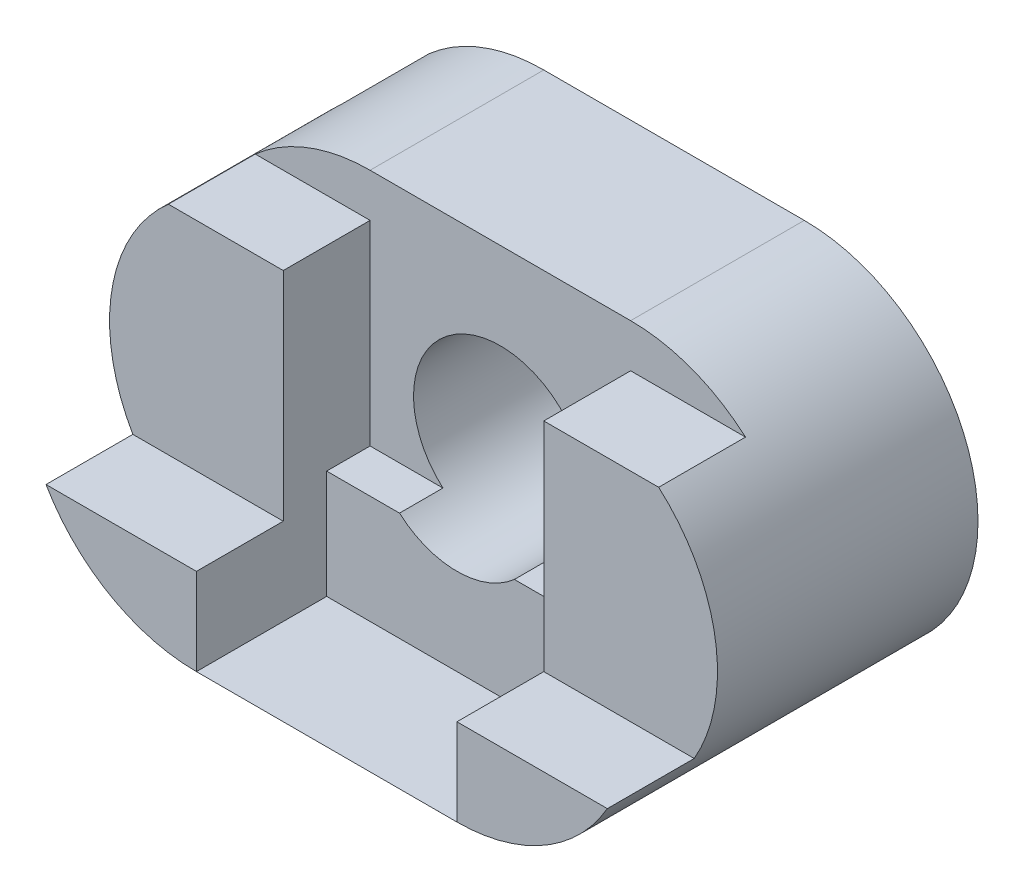
ISO-10303-21;
HEADER;
FILE_DESCRIPTION(('STEP AP214'),'2;1');
FILE_NAME('part.step','',(''),(''),'','','');
FILE_SCHEMA(('AUTOMOTIVE_DESIGN { 1 0 10303 214 1 1 1 1 }'));
ENDSEC;
DATA;
#1=APPLICATION_CONTEXT('core data for automotive mechanical design processes');
#2=APPLICATION_PROTOCOL_DEFINITION('international standard','automotive_design',2000,#1);
#3=PRODUCT_CONTEXT('',#1,'mechanical');
#4=PRODUCT('Part','Part','',(#3));
#5=PRODUCT_RELATED_PRODUCT_CATEGORY('part','',(#4));
#6=PRODUCT_DEFINITION_FORMATION('','',#4);
#7=PRODUCT_DEFINITION_CONTEXT('part definition',#1,'design');
#8=PRODUCT_DEFINITION('design','',#6,#7);
#9=PRODUCT_DEFINITION_SHAPE('','',#8);
#10=(LENGTH_UNIT() NAMED_UNIT(*) SI_UNIT(.MILLI.,.METRE.));
#11=(NAMED_UNIT(*) PLANE_ANGLE_UNIT() SI_UNIT($,.RADIAN.));
#12=(NAMED_UNIT(*) SI_UNIT($,.STERADIAN.) SOLID_ANGLE_UNIT());
#13=UNCERTAINTY_MEASURE_WITH_UNIT(LENGTH_MEASURE(1.E-05),#10,'distance_accuracy_value','');
#14=(GEOMETRIC_REPRESENTATION_CONTEXT(3) GLOBAL_UNCERTAINTY_ASSIGNED_CONTEXT((#13)) GLOBAL_UNIT_ASSIGNED_CONTEXT((#10,
#11,#12)) REPRESENTATION_CONTEXT('',''));
#15=CARTESIAN_POINT('',(0.,0.,0.));
#16=DIRECTION('',(0.,0.,1.));
#17=DIRECTION('',(1.,0.,0.));
#18=AXIS2_PLACEMENT_3D('',#15,#16,#17);
#19=CARTESIAN_POINT('',(0.,0.,50.));
#20=DIRECTION('',(0.,0.,1.));
#21=DIRECTION('',(1.,0.,0.));
#22=AXIS2_PLACEMENT_3D('',#19,#20,#21);
#23=PLANE('',#22);
#24=DIRECTION('',(0.,-1.,0.));
#25=VECTOR('',#24,1.);
#26=CARTESIAN_POINT('',(0.,0.,50.));
#27=LINE('',#26,#25);
#28=CARTESIAN_POINT('',(0.,-15.,50.));
#29=VERTEX_POINT('',#28);
#30=CARTESIAN_POINT('',(0.,-39.9999,50.));
#31=VERTEX_POINT('',#30);
#32=EDGE_CURVE('E246',#29,#31,#27,.T.);
#33=ORIENTED_EDGE('',*,*,#32,.T.);
#34=DIRECTION('',(1.,0.,0.));
#35=VECTOR('',#34,1.);
#36=CARTESIAN_POINT('',(60.0000000000004,-39.9999,50.));
#37=LINE('',#36,#35);
#38=CARTESIAN_POINT('',(60.0000000000004,-39.9999,50.));
#39=VERTEX_POINT('',#38);
#40=EDGE_CURVE('E207',#31,#39,#37,.T.);
#41=ORIENTED_EDGE('',*,*,#40,.T.);
#42=DIRECTION('',(0.,-1.,0.));
#43=VECTOR('',#42,1.);
#44=CARTESIAN_POINT('',(60.,-20.,50.));
#45=LINE('',#44,#43);
#46=CARTESIAN_POINT('',(60.,-15.,50.));
#47=VERTEX_POINT('',#46);
#48=EDGE_CURVE('E221',#47,#39,#45,.T.);
#49=ORIENTED_EDGE('',*,*,#48,.F.);
#50=DIRECTION('',(-1.,0.,0.));
#51=VECTOR('',#50,1.);
#52=CARTESIAN_POINT('',(0.,-15.,50.));
#53=LINE('',#52,#51);
#54=CARTESIAN_POINT('',(43.2287565553229,-15.,50.));
#55=VERTEX_POINT('',#54);
#56=EDGE_CURVE('E239',#47,#55,#53,.T.);
#57=ORIENTED_EDGE('',*,*,#56,.T.);
#58=CARTESIAN_POINT('',(30.,0.,50.));
#59=DIRECTION('',(0.,0.,1.));
#60=DIRECTION('',(1.,0.,0.));
#61=AXIS2_PLACEMENT_3D('',#58,#59,#60);
#62=CIRCLE('',#61,20.);
#63=CARTESIAN_POINT('',(16.7712434446771,-15.,50.));
#64=VERTEX_POINT('',#63);
#65=EDGE_CURVE('E241',#55,#64,#62,.F.);
#66=ORIENTED_EDGE('',*,*,#65,.T.);
#67=DIRECTION('',(-1.,0.,0.));
#68=VECTOR('',#67,1.);
#69=CARTESIAN_POINT('',(0.,-15.,50.));
#70=LINE('',#69,#68);
#71=EDGE_CURVE('E243',#64,#29,#70,.T.);
#72=ORIENTED_EDGE('',*,*,#71,.T.);
#73=EDGE_LOOP('',(#33,#41,#49,#57,#66,#72));
#74=FACE_BOUND('',#73,.T.);
#75=ADVANCED_FACE('F35',(#74),#23,.T.);
#76=CARTESIAN_POINT('',(60.,-40.,50.));
#77=DIRECTION('',(1.,0.,0.));
#78=DIRECTION('',(0.,0.,-1.));
#79=AXIS2_PLACEMENT_3D('',#76,#77,#78);
#80=PLANE('',#79);
#81=DIRECTION('',(0.,0.,1.));
#82=VECTOR('',#81,1.);
#83=CARTESIAN_POINT('',(60.0000000000004,-39.9999,50.));
#84=LINE('',#83,#82);
#85=CARTESIAN_POINT('',(60.0000000000004,-39.9999,80.));
#86=VERTEX_POINT('',#85);
#87=EDGE_CURVE('E198',#39,#86,#84,.T.);
#88=ORIENTED_EDGE('',*,*,#87,.T.);
#89=DIRECTION('',(0.,-1.,0.));
#90=VECTOR('',#89,1.);
#91=CARTESIAN_POINT('',(60.,-20.,80.));
#92=LINE('',#91,#90);
#93=CARTESIAN_POINT('',(60.,-20.,80.));
#94=VERTEX_POINT('',#93);
#95=EDGE_CURVE('E225',#94,#86,#92,.T.);
#96=ORIENTED_EDGE('',*,*,#95,.F.);
#97=DIRECTION('',(0.,0.,-1.));
#98=VECTOR('',#97,1.);
#99=CARTESIAN_POINT('',(60.,-20.,80.));
#100=LINE('',#99,#98);
#101=CARTESIAN_POINT('',(60.,-20.,60.));
#102=VERTEX_POINT('',#101);
#103=EDGE_CURVE('E235',#94,#102,#100,.T.);
#104=ORIENTED_EDGE('',*,*,#103,.T.);
#105=DIRECTION('',(0.,-1.,0.));
#106=VECTOR('',#105,1.);
#107=CARTESIAN_POINT('',(60.,30.,60.));
#108=LINE('',#107,#106);
#109=CARTESIAN_POINT('',(60.,30.,60.));
#110=VERTEX_POINT('',#109);
#111=EDGE_CURVE('E214',#110,#102,#108,.T.);
#112=ORIENTED_EDGE('',*,*,#111,.F.);
#113=DIRECTION('',(0.,0.,1.));
#114=VECTOR('',#113,1.);
#115=CARTESIAN_POINT('',(60.,30.,60.));
#116=LINE('',#115,#114);
#117=CARTESIAN_POINT('',(60.,30.,40.));
#118=VERTEX_POINT('',#117);
#119=EDGE_CURVE('E272',#118,#110,#116,.T.);
#120=ORIENTED_EDGE('',*,*,#119,.F.);
#121=DIRECTION('',(0.,1.,0.));
#122=VECTOR('',#121,1.);
#123=CARTESIAN_POINT('',(60.,0.,40.));
#124=LINE('',#123,#122);
#125=CARTESIAN_POINT('',(60.,-15.,40.));
#126=VERTEX_POINT('',#125);
#127=EDGE_CURVE('E263',#126,#118,#124,.T.);
#128=ORIENTED_EDGE('',*,*,#127,.F.);
#129=DIRECTION('',(0.,0.,-1.));
#130=VECTOR('',#129,1.);
#131=CARTESIAN_POINT('',(60.,-15.,80.));
#132=LINE('',#131,#130);
#133=EDGE_CURVE('E269',#47,#126,#132,.T.);
#134=ORIENTED_EDGE('',*,*,#133,.F.);
#135=ORIENTED_EDGE('',*,*,#48,.T.);
#136=EDGE_LOOP('',(#88,#96,#104,#112,#120,#128,#134,#135));
#137=FACE_BOUND('',#136,.T.);
#138=ADVANCED_FACE('F391',(#137),#80,.F.);
#139=CARTESIAN_POINT('',(0.,-40.,50.));
#140=DIRECTION('',(-1.,0.,0.));
#141=DIRECTION('',(0.,0.,1.));
#142=AXIS2_PLACEMENT_3D('',#139,#140,#141);
#143=PLANE('',#142);
#144=DIRECTION('',(0.,0.,-1.));
#145=VECTOR('',#144,1.);
#146=CARTESIAN_POINT('',(0.,-39.9999,50.));
#147=LINE('',#146,#145);
#148=CARTESIAN_POINT('',(0.,-39.9999,80.));
#149=VERTEX_POINT('',#148);
#150=EDGE_CURVE('E204',#149,#31,#147,.T.);
#151=ORIENTED_EDGE('',*,*,#150,.T.);
#152=ORIENTED_EDGE('',*,*,#32,.F.);
#153=DIRECTION('',(0.,0.,1.));
#154=VECTOR('',#153,1.);
#155=CARTESIAN_POINT('',(0.,-15.,50.));
#156=LINE('',#155,#154);
#157=CARTESIAN_POINT('',(0.,-15.,40.));
#158=VERTEX_POINT('',#157);
#159=EDGE_CURVE('E337',#158,#29,#156,.T.);
#160=ORIENTED_EDGE('',*,*,#159,.F.);
#161=DIRECTION('',(0.,-1.,0.));
#162=VECTOR('',#161,1.);
#163=CARTESIAN_POINT('',(0.,0.,40.));
#164=LINE('',#163,#162);
#165=CARTESIAN_POINT('',(0.,30.,40.));
#166=VERTEX_POINT('',#165);
#167=EDGE_CURVE('E249',#166,#158,#164,.T.);
#168=ORIENTED_EDGE('',*,*,#167,.F.);
#169=DIRECTION('',(0.,0.,1.));
#170=VECTOR('',#169,1.);
#171=CARTESIAN_POINT('',(0.,30.,60.));
#172=LINE('',#171,#170);
#173=CARTESIAN_POINT('',(0.,30.,60.));
#174=VERTEX_POINT('',#173);
#175=EDGE_CURVE('E274',#166,#174,#172,.T.);
#176=ORIENTED_EDGE('',*,*,#175,.T.);
#177=DIRECTION('',(0.,1.,0.));
#178=VECTOR('',#177,1.);
#179=CARTESIAN_POINT('',(0.,40.,60.));
#180=LINE('',#179,#178);
#181=CARTESIAN_POINT('',(0.,-20.,60.));
#182=VERTEX_POINT('',#181);
#183=EDGE_CURVE('E277',#182,#174,#180,.T.);
#184=ORIENTED_EDGE('',*,*,#183,.F.);
#185=DIRECTION('',(0.,0.,-1.));
#186=VECTOR('',#185,1.);
#187=CARTESIAN_POINT('',(0.,-20.,80.));
#188=LINE('',#187,#186);
#189=CARTESIAN_POINT('',(0.,-20.,80.));
#190=VERTEX_POINT('',#189);
#191=EDGE_CURVE('E334',#190,#182,#188,.T.);
#192=ORIENTED_EDGE('',*,*,#191,.F.);
#193=DIRECTION('',(0.,-1.,0.));
#194=VECTOR('',#193,1.);
#195=CARTESIAN_POINT('',(0.,0.,80.));
#196=LINE('',#195,#194);
#197=EDGE_CURVE('E238',#190,#149,#196,.T.);
#198=ORIENTED_EDGE('',*,*,#197,.T.);
#199=EDGE_LOOP('',(#151,#152,#160,#168,#176,#184,#192,#198));
#200=FACE_BOUND('',#199,.T.);
#201=ADVANCED_FACE('F376',(#200),#143,.F.);
#202=CARTESIAN_POINT('',(60.,-20.,80.));
#203=DIRECTION('',(0.,-1.,0.));
#204=DIRECTION('',(1.,0.,0.));
#205=AXIS2_PLACEMENT_3D('',#202,#203,#204);
#206=PLANE('',#205);
#207=DIRECTION('',(1.,0.,0.));
#208=VECTOR('',#207,1.);
#209=CARTESIAN_POINT('',(60.,-20.,60.));
#210=LINE('',#209,#208);
#211=CARTESIAN_POINT('',(94.6410161513775,-20.,60.));
#212=VERTEX_POINT('',#211);
#213=EDGE_CURVE('E216',#102,#212,#210,.T.);
#214=ORIENTED_EDGE('',*,*,#213,.F.);
#215=ORIENTED_EDGE('',*,*,#103,.F.);
#216=DIRECTION('',(-1.,0.,0.));
#217=VECTOR('',#216,1.);
#218=CARTESIAN_POINT('',(60.,-20.,80.));
#219=LINE('',#218,#217);
#220=CARTESIAN_POINT('',(94.6410161513775,-20.,80.));
#221=VERTEX_POINT('',#220);
#222=EDGE_CURVE('E222',#221,#94,#219,.T.);
#223=ORIENTED_EDGE('',*,*,#222,.F.);
#224=DIRECTION('',(0.,0.,-1.));
#225=VECTOR('',#224,1.);
#226=CARTESIAN_POINT('',(94.6410161513775,-20.,80.));
#227=LINE('',#226,#225);
#228=EDGE_CURVE('E230',#221,#212,#227,.T.);
#229=ORIENTED_EDGE('',*,*,#228,.T.);
#230=EDGE_LOOP('',(#214,#215,#223,#229));
#231=FACE_BOUND('',#230,.T.);
#232=ADVANCED_FACE('F394',(#231),#206,.F.);
#233=CARTESIAN_POINT('',(60.,0.,80.));
#234=DIRECTION('',(0.,0.,-1.));
#235=DIRECTION('',(-1.,0.,0.));
#236=AXIS2_PLACEMENT_3D('',#233,#234,#235);
#237=CYLINDRICAL_SURFACE('',#236,40.);
#238=DIRECTION('',(0.,0.,-1.));
#239=VECTOR('',#238,1.);
#240=CARTESIAN_POINT('',(86.4575131106459,30.,80.));
#241=LINE('',#240,#239);
#242=CARTESIAN_POINT('',(86.4575131106459,30.,60.));
#243=VERTEX_POINT('',#242);
#244=CARTESIAN_POINT('',(86.4575131106459,30.,40.));
#245=VERTEX_POINT('',#244);
#246=EDGE_CURVE('E285',#243,#245,#241,.T.);
#247=ORIENTED_EDGE('',*,*,#246,.F.);
#248=CARTESIAN_POINT('',(60.0000000000001,0.,60.));
#249=DIRECTION('',(0.,0.,1.));
#250=DIRECTION('',(-1.,0.,0.));
#251=AXIS2_PLACEMENT_3D('',#248,#249,#250);
#252=CIRCLE('',#251,40.);
#253=EDGE_CURVE('E218',#212,#243,#252,.T.);
#254=ORIENTED_EDGE('',*,*,#253,.F.);
#255=ORIENTED_EDGE('',*,*,#228,.F.);
#256=CARTESIAN_POINT('',(60.,0.,80.));
#257=DIRECTION('',(0.,0.,1.));
#258=DIRECTION('',(1.,0.,0.));
#259=AXIS2_PLACEMENT_3D('',#256,#257,#258);
#260=CIRCLE('',#259,40.);
#261=CARTESIAN_POINT('',(60.0000000000004,-40.,80.));
#262=VERTEX_POINT('',#261);
#263=EDGE_CURVE('E228',#262,#221,#260,.T.);
#264=ORIENTED_EDGE('',*,*,#263,.F.);
#265=DIRECTION('',(0.,0.,-1.));
#266=VECTOR('',#265,1.);
#267=CARTESIAN_POINT('',(60.,-40.,80.));
#268=LINE('',#267,#266);
#269=CARTESIAN_POINT('',(60.,-40.,0.));
#270=VERTEX_POINT('',#269);
#271=EDGE_CURVE('E327',#262,#270,#268,.T.);
#272=ORIENTED_EDGE('',*,*,#271,.T.);
#273=CARTESIAN_POINT('',(60.,0.,0.));
#274=DIRECTION('',(0.,0.,1.));
#275=DIRECTION('',(1.,0.,0.));
#276=AXIS2_PLACEMENT_3D('',#273,#274,#275);
#277=CIRCLE('',#276,40.);
#278=CARTESIAN_POINT('',(60.,40.,0.));
#279=VERTEX_POINT('',#278);
#280=EDGE_CURVE('E319',#270,#279,#277,.T.);
#281=ORIENTED_EDGE('',*,*,#280,.T.);
#282=DIRECTION('',(0.,0.,-1.));
#283=VECTOR('',#282,1.);
#284=CARTESIAN_POINT('',(60.,40.,80.));
#285=LINE('',#284,#283);
#286=CARTESIAN_POINT('',(60.,40.,40.));
#287=VERTEX_POINT('',#286);
#288=EDGE_CURVE('E325',#287,#279,#285,.T.);
#289=ORIENTED_EDGE('',*,*,#288,.F.);
#290=CARTESIAN_POINT('',(60.,0.,40.));
#291=DIRECTION('',(0.,0.,1.));
#292=DIRECTION('',(1.,0.,0.));
#293=AXIS2_PLACEMENT_3D('',#290,#291,#292);
#294=CIRCLE('',#293,40.);
#295=EDGE_CURVE('E288',#245,#287,#294,.T.);
#296=ORIENTED_EDGE('',*,*,#295,.F.);
#297=EDGE_LOOP('',(#247,#254,#255,#264,#272,#281,#289,#296));
#298=FACE_BOUND('',#297,.T.);
#299=ADVANCED_FACE('F354',(#298),#237,.T.);
#300=CARTESIAN_POINT('',(0.,-15.,80.));
#301=DIRECTION('',(0.,-1.,0.));
#302=DIRECTION('',(0.,0.,-1.));
#303=AXIS2_PLACEMENT_3D('',#300,#301,#302);
#304=PLANE('',#303);
#305=ORIENTED_EDGE('',*,*,#71,.F.);
#306=DIRECTION('',(0.,0.,-1.));
#307=VECTOR('',#306,1.);
#308=CARTESIAN_POINT('',(16.7712434446771,-15.,80.));
#309=LINE('',#308,#307);
#310=CARTESIAN_POINT('',(16.7712434446771,-15.,40.));
#311=VERTEX_POINT('',#310);
#312=EDGE_CURVE('E266',#64,#311,#309,.T.);
#313=ORIENTED_EDGE('',*,*,#312,.T.);
#314=DIRECTION('',(1.,0.,0.));
#315=VECTOR('',#314,1.);
#316=CARTESIAN_POINT('',(0.,-15.,40.));
#317=LINE('',#316,#315);
#318=EDGE_CURVE('E254',#158,#311,#317,.T.);
#319=ORIENTED_EDGE('',*,*,#318,.F.);
#320=ORIENTED_EDGE('',*,*,#159,.T.);
#321=EDGE_LOOP('',(#305,#313,#319,#320));
#322=FACE_BOUND('',#321,.T.);
#323=ADVANCED_FACE('F405',(#322),#304,.F.);
#324=CARTESIAN_POINT('',(30.,0.,0.));
#325=DIRECTION('',(0.,0.,1.));
#326=DIRECTION('',(1.,0.,0.));
#327=AXIS2_PLACEMENT_3D('',#324,#325,#326);
#328=CYLINDRICAL_SURFACE('',#327,20.);
#329=CARTESIAN_POINT('',(30.,0.,0.));
#330=DIRECTION('',(0.,0.,1.));
#331=DIRECTION('',(1.,0.,0.));
#332=AXIS2_PLACEMENT_3D('',#329,#330,#331);
#333=CIRCLE('',#332,20.);
#334=CARTESIAN_POINT('',(50.,0.,0.));
#335=VERTEX_POINT('',#334);
#336=EDGE_CURVE('E305',#335,#335,#333,.T.);
#337=ORIENTED_EDGE('',*,*,#336,.F.);
#338=EDGE_LOOP('',(#337));
#339=FACE_BOUND('',#338,.T.);
#340=ORIENTED_EDGE('',*,*,#65,.F.);
#341=DIRECTION('',(0.,0.,-1.));
#342=VECTOR('',#341,1.);
#343=CARTESIAN_POINT('',(43.2287565553229,-15.,80.));
#344=LINE('',#343,#342);
#345=CARTESIAN_POINT('',(43.2287565553229,-15.,40.));
#346=VERTEX_POINT('',#345);
#347=EDGE_CURVE('E267',#55,#346,#344,.T.);
#348=ORIENTED_EDGE('',*,*,#347,.T.);
#349=CARTESIAN_POINT('',(30.,0.,40.));
#350=DIRECTION('',(0.,0.,1.));
#351=DIRECTION('',(1.,0.,0.));
#352=AXIS2_PLACEMENT_3D('',#349,#350,#351);
#353=CIRCLE('',#352,20.);
#354=EDGE_CURVE('E257',#311,#346,#353,.F.);
#355=ORIENTED_EDGE('',*,*,#354,.F.);
#356=ORIENTED_EDGE('',*,*,#312,.F.);
#357=EDGE_LOOP('',(#340,#348,#355,#356));
#358=FACE_BOUND('',#357,.T.);
#359=ADVANCED_FACE('F408',(#339,#358),#328,.F.);
#360=CARTESIAN_POINT('',(0.,-40.,80.));
#361=DIRECTION('',(0.,1.,0.));
#362=DIRECTION('',(0.,0.,1.));
#363=AXIS2_PLACEMENT_3D('',#360,#361,#362);
#364=PLANE('',#363);
#365=ORIENTED_EDGE('',*,*,#271,.F.);
#366=DIRECTION('',(-1.,0.,0.));
#367=VECTOR('',#366,1.);
#368=CARTESIAN_POINT('',(60.0000000000004,-40.,80.));
#369=LINE('',#368,#367);
#370=CARTESIAN_POINT('',(0.,-40.,80.));
#371=VERTEX_POINT('',#370);
#372=EDGE_CURVE('E197',#262,#371,#369,.T.);
#373=ORIENTED_EDGE('',*,*,#372,.T.);
#374=DIRECTION('',(0.,0.,-1.));
#375=VECTOR('',#374,1.);
#376=CARTESIAN_POINT('',(0.,-40.,80.));
#377=LINE('',#376,#375);
#378=CARTESIAN_POINT('',(0.,-40.,20.));
#379=VERTEX_POINT('',#378);
#380=EDGE_CURVE('E329',#371,#379,#377,.T.);
#381=ORIENTED_EDGE('',*,*,#380,.T.);
#382=DIRECTION('',(0.,0.,-1.));
#383=VECTOR('',#382,1.);
#384=CARTESIAN_POINT('',(0.,-40.,0.));
#385=LINE('',#384,#383);
#386=CARTESIAN_POINT('',(0.,-40.,0.));
#387=VERTEX_POINT('',#386);
#388=EDGE_CURVE('E183',#379,#387,#385,.T.);
#389=ORIENTED_EDGE('',*,*,#388,.T.);
#390=DIRECTION('',(1.,0.,0.));
#391=VECTOR('',#390,1.);
#392=CARTESIAN_POINT('',(0.,-40.,0.));
#393=LINE('',#392,#391);
#394=EDGE_CURVE('E316',#387,#270,#393,.T.);
#395=ORIENTED_EDGE('',*,*,#394,.T.);
#396=EDGE_LOOP('',(#365,#373,#381,#389,#395));
#397=FACE_BOUND('',#396,.T.);
#398=ADVANCED_FACE('F360',(#397),#364,.F.);
#399=CARTESIAN_POINT('',(170.,30.,60.));
#400=DIRECTION('',(0.,1.,0.));
#401=DIRECTION('',(0.,0.,1.));
#402=AXIS2_PLACEMENT_3D('',#399,#400,#401);
#403=PLANE('',#402);
#404=ORIENTED_EDGE('',*,*,#119,.T.);
#405=DIRECTION('',(-1.,0.,0.));
#406=VECTOR('',#405,1.);
#407=CARTESIAN_POINT('',(60.,30.,60.));
#408=LINE('',#407,#406);
#409=EDGE_CURVE('E210',#243,#110,#408,.T.);
#410=ORIENTED_EDGE('',*,*,#409,.F.);
#411=ORIENTED_EDGE('',*,*,#246,.T.);
#412=DIRECTION('',(-1.,0.,0.));
#413=VECTOR('',#412,1.);
#414=CARTESIAN_POINT('',(170.,30.,40.));
#415=LINE('',#414,#413);
#416=EDGE_CURVE('E282',#245,#118,#415,.T.);
#417=ORIENTED_EDGE('',*,*,#416,.T.);
#418=EDGE_LOOP('',(#404,#410,#411,#417));
#419=FACE_BOUND('',#418,.T.);
#420=ADVANCED_FACE('F387',(#419),#403,.T.);
#421=CARTESIAN_POINT('',(0.,0.,80.));
#422=DIRECTION('',(0.,0.,-1.));
#423=DIRECTION('',(-1.,0.,0.));
#424=AXIS2_PLACEMENT_3D('',#421,#422,#423);
#425=CYLINDRICAL_SURFACE('',#424,40.);
#426=DIRECTION('',(0.,0.,-1.));
#427=VECTOR('',#426,1.);
#428=CARTESIAN_POINT('',(-26.4575131106459,30.,80.));
#429=LINE('',#428,#427);
#430=CARTESIAN_POINT('',(-26.4575131106459,30.,0.));
#431=VERTEX_POINT('',#430);
#432=CARTESIAN_POINT('',(-26.4575131106459,30.,20.));
#433=VERTEX_POINT('',#432);
#434=EDGE_CURVE('E182',#431,#433,#429,.F.);
#435=ORIENTED_EDGE('',*,*,#434,.T.);
#436=CARTESIAN_POINT('',(0.,0.,20.));
#437=DIRECTION('',(0.,0.,1.));
#438=DIRECTION('',(1.,0.,0.));
#439=AXIS2_PLACEMENT_3D('',#436,#437,#438);
#440=CIRCLE('',#439,40.);
#441=EDGE_CURVE('E11',#433,#379,#440,.T.);
#442=ORIENTED_EDGE('',*,*,#441,.T.);
#443=ORIENTED_EDGE('',*,*,#380,.F.);
#444=CARTESIAN_POINT('',(0.,0.,80.));
#445=DIRECTION('',(0.,0.,1.));
#446=DIRECTION('',(1.,0.,0.));
#447=AXIS2_PLACEMENT_3D('',#444,#445,#446);
#448=CIRCLE('',#447,40.);
#449=CARTESIAN_POINT('',(-34.6410161513775,-20.,80.));
#450=VERTEX_POINT('',#449);
#451=EDGE_CURVE('E309',#450,#371,#448,.T.);
#452=ORIENTED_EDGE('',*,*,#451,.F.);
#453=DIRECTION('',(0.,0.,-1.));
#454=VECTOR('',#453,1.);
#455=CARTESIAN_POINT('',(-34.6410161513775,-20.,80.));
#456=LINE('',#455,#454);
#457=CARTESIAN_POINT('',(-34.6410161513775,-20.,60.));
#458=VERTEX_POINT('',#457);
#459=EDGE_CURVE('E297',#450,#458,#456,.T.);
#460=ORIENTED_EDGE('',*,*,#459,.T.);
#461=CARTESIAN_POINT('',(0.,0.,60.));
#462=DIRECTION('',(0.,0.,-1.));
#463=DIRECTION('',(0.,1.,0.));
#464=AXIS2_PLACEMENT_3D('',#461,#462,#463);
#465=CIRCLE('',#464,40.);
#466=CARTESIAN_POINT('',(-26.4575131106459,30.,60.));
#467=VERTEX_POINT('',#466);
#468=EDGE_CURVE('E302',#458,#467,#465,.T.);
#469=ORIENTED_EDGE('',*,*,#468,.T.);
#470=DIRECTION('',(0.,0.,-1.));
#471=VECTOR('',#470,1.);
#472=CARTESIAN_POINT('',(-26.4575131106459,30.,80.));
#473=LINE('',#472,#471);
#474=CARTESIAN_POINT('',(-26.4575131106459,30.,40.));
#475=VERTEX_POINT('',#474);
#476=EDGE_CURVE('E58',#475,#467,#473,.F.);
#477=ORIENTED_EDGE('',*,*,#476,.F.);
#478=CARTESIAN_POINT('',(0.,0.,40.));
#479=DIRECTION('',(0.,0.,1.));
#480=DIRECTION('',(1.,0.,0.));
#481=AXIS2_PLACEMENT_3D('',#478,#479,#480);
#482=CIRCLE('',#481,40.);
#483=CARTESIAN_POINT('',(0.,40.,40.));
#484=VERTEX_POINT('',#483);
#485=EDGE_CURVE('E290',#484,#475,#482,.T.);
#486=ORIENTED_EDGE('',*,*,#485,.F.);
#487=DIRECTION('',(0.,0.,-1.));
#488=VECTOR('',#487,1.);
#489=CARTESIAN_POINT('',(0.,40.,80.));
#490=LINE('',#489,#488);
#491=CARTESIAN_POINT('',(0.,40.,0.));
#492=VERTEX_POINT('',#491);
#493=EDGE_CURVE('E312',#484,#492,#490,.T.);
#494=ORIENTED_EDGE('',*,*,#493,.T.);
#495=CARTESIAN_POINT('',(0.,0.,0.));
#496=DIRECTION('',(0.,0.,1.));
#497=DIRECTION('',(1.,0.,0.));
#498=AXIS2_PLACEMENT_3D('',#495,#496,#497);
#499=CIRCLE('',#498,40.);
#500=EDGE_CURVE('E308',#492,#431,#499,.T.);
#501=ORIENTED_EDGE('',*,*,#500,.T.);
#502=EDGE_LOOP('',(#435,#442,#443,#452,#460,#469,#477,#486,#494,#501));
#503=FACE_BOUND('',#502,.T.);
#504=ADVANCED_FACE('F37',(#503),#425,.T.);
#505=CARTESIAN_POINT('',(0.,40.,80.));
#506=DIRECTION('',(0.,-1.,0.));
#507=DIRECTION('',(0.,0.,-1.));
#508=AXIS2_PLACEMENT_3D('',#505,#506,#507);
#509=PLANE('',#508);
#510=DIRECTION('',(-1.,0.,0.));
#511=VECTOR('',#510,1.);
#512=CARTESIAN_POINT('',(170.,40.,40.));
#513=LINE('',#512,#511);
#514=EDGE_CURVE('E279',#287,#484,#513,.T.);
#515=ORIENTED_EDGE('',*,*,#514,.F.);
#516=ORIENTED_EDGE('',*,*,#288,.T.);
#517=DIRECTION('',(-1.,0.,0.));
#518=VECTOR('',#517,1.);
#519=CARTESIAN_POINT('',(0.,40.,0.));
#520=LINE('',#519,#518);
#521=EDGE_CURVE('E313',#279,#492,#520,.T.);
#522=ORIENTED_EDGE('',*,*,#521,.T.);
#523=ORIENTED_EDGE('',*,*,#493,.F.);
#524=EDGE_LOOP('',(#515,#516,#522,#523));
#525=FACE_BOUND('',#524,.T.);
#526=ADVANCED_FACE('F350',(#525),#509,.F.);
#527=CARTESIAN_POINT('',(-60.,40.,60.));
#528=DIRECTION('',(0.,0.,-1.));
#529=DIRECTION('',(0.,1.,0.));
#530=AXIS2_PLACEMENT_3D('',#527,#528,#529);
#531=PLANE('',#530);
#532=ORIENTED_EDGE('',*,*,#183,.T.);
#533=DIRECTION('',(1.,0.,0.));
#534=VECTOR('',#533,1.);
#535=CARTESIAN_POINT('',(-60.,30.,60.));
#536=LINE('',#535,#534);
#537=EDGE_CURVE('E332',#467,#174,#536,.T.);
#538=ORIENTED_EDGE('',*,*,#537,.F.);
#539=ORIENTED_EDGE('',*,*,#468,.F.);
#540=DIRECTION('',(1.,0.,0.));
#541=VECTOR('',#540,1.);
#542=CARTESIAN_POINT('',(-60.,-20.,60.));
#543=LINE('',#542,#541);
#544=EDGE_CURVE('E294',#458,#182,#543,.T.);
#545=ORIENTED_EDGE('',*,*,#544,.T.);
#546=EDGE_LOOP('',(#532,#538,#539,#545));
#547=FACE_BOUND('',#546,.T.);
#548=ADVANCED_FACE('F371',(#547),#531,.F.);
#549=CARTESIAN_POINT('',(0.,0.,80.));
#550=DIRECTION('',(0.,0.,1.));
#551=DIRECTION('',(1.,0.,0.));
#552=AXIS2_PLACEMENT_3D('',#549,#550,#551);
#553=PLANE('',#552);
#554=ORIENTED_EDGE('',*,*,#197,.F.);
#555=DIRECTION('',(1.,0.,0.));
#556=VECTOR('',#555,1.);
#557=CARTESIAN_POINT('',(-60.,-20.,80.));
#558=LINE('',#557,#556);
#559=EDGE_CURVE('E293',#450,#190,#558,.T.);
#560=ORIENTED_EDGE('',*,*,#559,.F.);
#561=ORIENTED_EDGE('',*,*,#451,.T.);
#562=ORIENTED_EDGE('',*,*,#372,.F.);
#563=ORIENTED_EDGE('',*,*,#263,.T.);
#564=ORIENTED_EDGE('',*,*,#222,.T.);
#565=ORIENTED_EDGE('',*,*,#95,.T.);
#566=DIRECTION('',(-1.,0.,0.));
#567=VECTOR('',#566,1.);
#568=CARTESIAN_POINT('',(60.0000000000004,-39.9999,80.));
#569=LINE('',#568,#567);
#570=EDGE_CURVE('E201',#86,#149,#569,.T.);
#571=ORIENTED_EDGE('',*,*,#570,.T.);
#572=EDGE_LOOP('',(#554,#560,#561,#562,#563,#564,#565,#571));
#573=FACE_BOUND('',#572,.T.);
#574=ADVANCED_FACE('F366',(#573),#553,.T.);
#575=CARTESIAN_POINT('',(0.,0.,0.));
#576=DIRECTION('',(0.,0.,1.));
#577=DIRECTION('',(1.,0.,0.));
#578=AXIS2_PLACEMENT_3D('',#575,#576,#577);
#579=PLANE('',#578);
#580=DIRECTION('',(0.,1.,0.));
#581=VECTOR('',#580,1.);
#582=CARTESIAN_POINT('',(0.,-40.,0.));
#583=LINE('',#582,#581);
#584=CARTESIAN_POINT('',(0.,30.,0.));
#585=VERTEX_POINT('',#584);
#586=EDGE_CURVE('E191',#387,#585,#583,.T.);
#587=ORIENTED_EDGE('',*,*,#586,.T.);
#588=DIRECTION('',(-1.,0.,0.));
#589=VECTOR('',#588,1.);
#590=CARTESIAN_POINT('',(0.,30.,0.));
#591=LINE('',#590,#589);
#592=EDGE_CURVE('E43',#585,#431,#591,.T.);
#593=ORIENTED_EDGE('',*,*,#592,.T.);
#594=ORIENTED_EDGE('',*,*,#500,.F.);
#595=ORIENTED_EDGE('',*,*,#521,.F.);
#596=ORIENTED_EDGE('',*,*,#280,.F.);
#597=ORIENTED_EDGE('',*,*,#394,.F.);
#598=EDGE_LOOP('',(#587,#593,#594,#595,#596,#597));
#599=FACE_BOUND('',#598,.T.);
#600=ORIENTED_EDGE('',*,*,#336,.T.);
#601=EDGE_LOOP('',(#600));
#602=FACE_BOUND('',#601,.T.);
#603=ADVANCED_FACE('F341',(#599,#602),#579,.F.);
#604=CARTESIAN_POINT('',(-60.,-20.,80.));
#605=DIRECTION('',(0.,-1.,0.));
#606=DIRECTION('',(0.,0.,-1.));
#607=AXIS2_PLACEMENT_3D('',#604,#605,#606);
#608=PLANE('',#607);
#609=ORIENTED_EDGE('',*,*,#559,.T.);
#610=ORIENTED_EDGE('',*,*,#191,.T.);
#611=ORIENTED_EDGE('',*,*,#544,.F.);
#612=ORIENTED_EDGE('',*,*,#459,.F.);
#613=EDGE_LOOP('',(#609,#610,#611,#612));
#614=FACE_BOUND('',#613,.T.);
#615=ADVANCED_FACE('F368',(#614),#608,.F.);
#616=CARTESIAN_POINT('',(170.,40.,40.));
#617=DIRECTION('',(0.,0.,1.));
#618=DIRECTION('',(1.,0.,0.));
#619=AXIS2_PLACEMENT_3D('',#616,#617,#618);
#620=PLANE('',#619);
#621=ORIENTED_EDGE('',*,*,#485,.T.);
#622=EDGE_CURVE('E281',#166,#475,#415,.T.);
#623=ORIENTED_EDGE('',*,*,#622,.F.);
#624=ORIENTED_EDGE('',*,*,#167,.T.);
#625=ORIENTED_EDGE('',*,*,#318,.T.);
#626=ORIENTED_EDGE('',*,*,#354,.T.);
#627=DIRECTION('',(1.,0.,0.));
#628=VECTOR('',#627,1.);
#629=CARTESIAN_POINT('',(0.,-15.,40.));
#630=LINE('',#629,#628);
#631=EDGE_CURVE('E260',#346,#126,#630,.T.);
#632=ORIENTED_EDGE('',*,*,#631,.T.);
#633=ORIENTED_EDGE('',*,*,#127,.T.);
#634=ORIENTED_EDGE('',*,*,#416,.F.);
#635=ORIENTED_EDGE('',*,*,#295,.T.);
#636=ORIENTED_EDGE('',*,*,#514,.T.);
#637=EDGE_LOOP('',(#621,#623,#624,#625,#626,#632,#633,#634,#635,#636));
#638=FACE_BOUND('',#637,.T.);
#639=ADVANCED_FACE('F379',(#638),#620,.T.);
#640=ORIENTED_EDGE('',*,*,#175,.F.);
#641=ORIENTED_EDGE('',*,*,#622,.T.);
#642=ORIENTED_EDGE('',*,*,#476,.T.);
#643=ORIENTED_EDGE('',*,*,#537,.T.);
#644=EDGE_LOOP('',(#640,#641,#642,#643));
#645=FACE_BOUND('',#644,.T.);
#646=ADVANCED_FACE('F372',(#645),#403,.T.);
#647=ORIENTED_EDGE('',*,*,#56,.F.);
#648=ORIENTED_EDGE('',*,*,#133,.T.);
#649=ORIENTED_EDGE('',*,*,#631,.F.);
#650=ORIENTED_EDGE('',*,*,#347,.F.);
#651=EDGE_LOOP('',(#647,#648,#649,#650));
#652=FACE_BOUND('',#651,.T.);
#653=ADVANCED_FACE('F412',(#652),#304,.F.);
#654=CARTESIAN_POINT('',(60.0000000000001,0.,60.));
#655=DIRECTION('',(0.,0.,-1.));
#656=DIRECTION('',(-1.,0.,0.));
#657=AXIS2_PLACEMENT_3D('',#654,#655,#656);
#658=PLANE('',#657);
#659=ORIENTED_EDGE('',*,*,#409,.T.);
#660=ORIENTED_EDGE('',*,*,#111,.T.);
#661=ORIENTED_EDGE('',*,*,#213,.T.);
#662=ORIENTED_EDGE('',*,*,#253,.T.);
#663=EDGE_LOOP('',(#659,#660,#661,#662));
#664=FACE_BOUND('',#663,.T.);
#665=ADVANCED_FACE('F385',(#664),#658,.F.);
#666=CARTESIAN_POINT('',(0.,-39.9999,0.));
#667=DIRECTION('',(0.,-1.,0.));
#668=DIRECTION('',(0.,0.,-1.));
#669=AXIS2_PLACEMENT_3D('',#666,#667,#668);
#670=PLANE('',#669);
#671=ORIENTED_EDGE('',*,*,#87,.F.);
#672=ORIENTED_EDGE('',*,*,#40,.F.);
#673=ORIENTED_EDGE('',*,*,#150,.F.);
#674=ORIENTED_EDGE('',*,*,#570,.F.);
#675=EDGE_LOOP('',(#671,#672,#673,#674));
#676=FACE_BOUND('',#675,.T.);
#677=ADVANCED_FACE('F398',(#676),#670,.F.);
#678=CARTESIAN_POINT('',(-95.,-40.,20.));
#679=DIRECTION('',(0.,0.,1.));
#680=DIRECTION('',(1.,0.,0.));
#681=AXIS2_PLACEMENT_3D('',#678,#679,#680);
#682=PLANE('',#681);
#683=DIRECTION('',(1.,0.,0.));
#684=VECTOR('',#683,1.);
#685=CARTESIAN_POINT('',(-95.,30.,20.));
#686=LINE('',#685,#684);
#687=CARTESIAN_POINT('',(0.,30.,20.));
#688=VERTEX_POINT('',#687);
#689=EDGE_CURVE('E176',#433,#688,#686,.T.);
#690=ORIENTED_EDGE('',*,*,#689,.T.);
#691=DIRECTION('',(0.,-1.,0.));
#692=VECTOR('',#691,1.);
#693=CARTESIAN_POINT('',(0.,-40.,20.));
#694=LINE('',#693,#692);
#695=EDGE_CURVE('E178',#688,#379,#694,.T.);
#696=ORIENTED_EDGE('',*,*,#695,.T.);
#697=ORIENTED_EDGE('',*,*,#441,.F.);
#698=EDGE_LOOP('',(#690,#696,#697));
#699=FACE_BOUND('',#698,.T.);
#700=ADVANCED_FACE('F177',(#699),#682,.F.);
#701=CARTESIAN_POINT('',(-95.,30.,0.));
#702=DIRECTION('',(0.,1.,0.));
#703=DIRECTION('',(0.,0.,1.));
#704=AXIS2_PLACEMENT_3D('',#701,#702,#703);
#705=PLANE('',#704);
#706=ORIENTED_EDGE('',*,*,#592,.F.);
#707=DIRECTION('',(0.,0.,1.));
#708=VECTOR('',#707,1.);
#709=CARTESIAN_POINT('',(0.,30.,0.));
#710=LINE('',#709,#708);
#711=EDGE_CURVE('E50',#585,#688,#710,.T.);
#712=ORIENTED_EDGE('',*,*,#711,.T.);
#713=ORIENTED_EDGE('',*,*,#689,.F.);
#714=ORIENTED_EDGE('',*,*,#434,.F.);
#715=EDGE_LOOP('',(#706,#712,#713,#714));
#716=FACE_BOUND('',#715,.T.);
#717=ADVANCED_FACE('F188',(#716),#705,.F.);
#718=CARTESIAN_POINT('',(0.,0.,0.));
#719=DIRECTION('',(1.,0.,0.));
#720=DIRECTION('',(0.,0.,-1.));
#721=AXIS2_PLACEMENT_3D('',#718,#719,#720);
#722=PLANE('',#721);
#723=ORIENTED_EDGE('',*,*,#586,.F.);
#724=ORIENTED_EDGE('',*,*,#388,.F.);
#725=ORIENTED_EDGE('',*,*,#695,.F.);
#726=ORIENTED_EDGE('',*,*,#711,.F.);
#727=EDGE_LOOP('',(#723,#724,#725,#726));
#728=FACE_BOUND('',#727,.T.);
#729=ADVANCED_FACE('F185',(#728),#722,.F.);
#730=CLOSED_SHELL('',(#75,#138,#201,#232,#299,#323,#359,#398,#420,#504,#526,#548,#574,#603,#615,
#639,#646,#653,#665,#677,#700,#717,#729));
#731=MANIFOLD_SOLID_BREP('B2',#730);
#732=ADVANCED_BREP_SHAPE_REPRESENTATION('',(#18,#731),#14);
#733=SHAPE_DEFINITION_REPRESENTATION(#9,#732);
ENDSEC;
END-ISO-10303-21;
